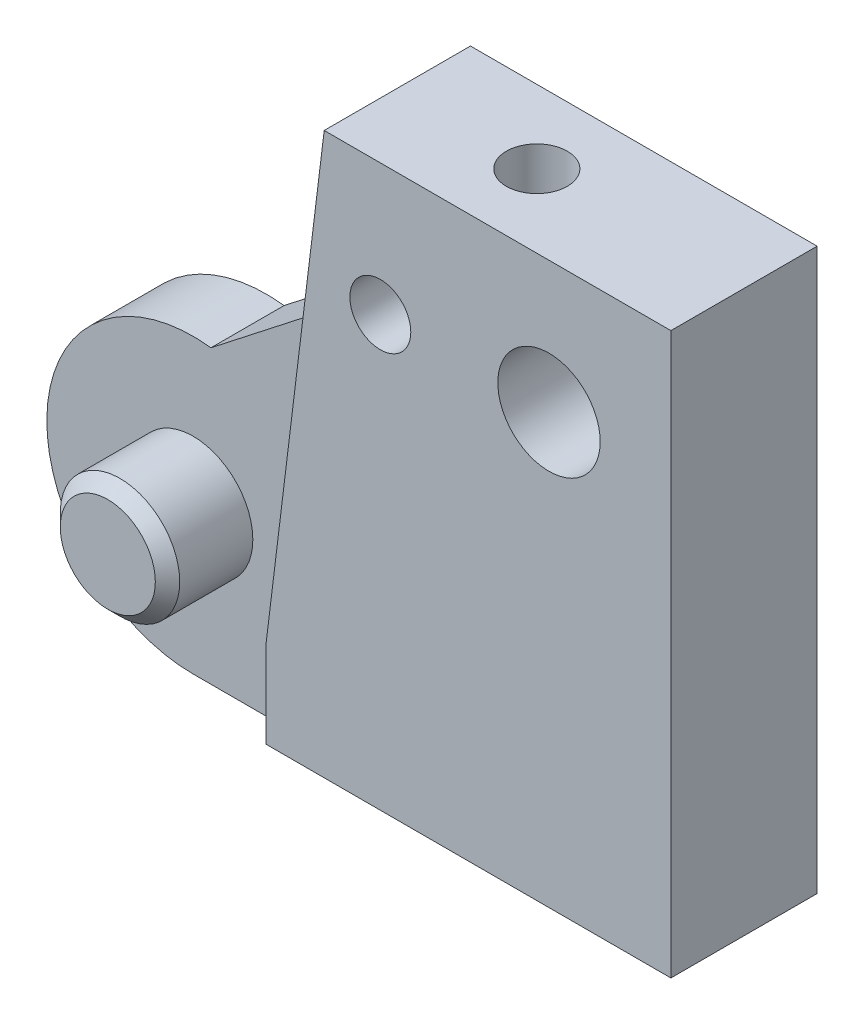
ISO-10303-21;
HEADER;
FILE_DESCRIPTION(('STEP AP214'),'2;1');
FILE_NAME('part.step','',(''),(''),'','','');
FILE_SCHEMA(('AUTOMOTIVE_DESIGN { 1 0 10303 214 1 1 1 1 }'));
ENDSEC;
DATA;
#1=APPLICATION_CONTEXT('core data for automotive mechanical design processes');
#2=APPLICATION_PROTOCOL_DEFINITION('international standard','automotive_design',2000,#1);
#3=PRODUCT_CONTEXT('',#1,'mechanical');
#4=PRODUCT('Part','Part','',(#3));
#5=PRODUCT_RELATED_PRODUCT_CATEGORY('part','',(#4));
#6=PRODUCT_DEFINITION_FORMATION('','',#4);
#7=PRODUCT_DEFINITION_CONTEXT('part definition',#1,'design');
#8=PRODUCT_DEFINITION('design','',#6,#7);
#9=PRODUCT_DEFINITION_SHAPE('','',#8);
#10=(LENGTH_UNIT() NAMED_UNIT(*) SI_UNIT(.MILLI.,.METRE.));
#11=(NAMED_UNIT(*) PLANE_ANGLE_UNIT() SI_UNIT($,.RADIAN.));
#12=(NAMED_UNIT(*) SI_UNIT($,.STERADIAN.) SOLID_ANGLE_UNIT());
#13=UNCERTAINTY_MEASURE_WITH_UNIT(LENGTH_MEASURE(1.E-05),#10,'distance_accuracy_value','');
#14=(GEOMETRIC_REPRESENTATION_CONTEXT(3) GLOBAL_UNCERTAINTY_ASSIGNED_CONTEXT((#13)) GLOBAL_UNIT_ASSIGNED_CONTEXT((#10,
#11,#12)) REPRESENTATION_CONTEXT('',''));
#15=CARTESIAN_POINT('',(0.,0.,0.));
#16=DIRECTION('',(0.,0.,1.));
#17=DIRECTION('',(1.,0.,0.));
#18=AXIS2_PLACEMENT_3D('',#15,#16,#17);
#19=CARTESIAN_POINT('',(0.,0.,3.));
#20=DIRECTION('',(0.,0.,1.));
#21=DIRECTION('',(1.,0.,0.));
#22=AXIS2_PLACEMENT_3D('',#19,#20,#21);
#23=PLANE('',#22);
#24=DIRECTION('',(0.121869343405148,0.992546151641322,0.));
#25=VECTOR('',#24,1.);
#26=CARTESIAN_POINT('',(0.,3.6330242790971,3.));
#27=LINE('',#26,#25);
#28=CARTESIAN_POINT('',(0.,3.6330242790971,3.));
#29=VERTEX_POINT('',#28);
#30=CARTESIAN_POINT('',(1.41770903070971,15.179337759265,3.));
#31=VERTEX_POINT('',#30);
#32=EDGE_CURVE('E52',#29,#31,#27,.T.);
#33=ORIENTED_EDGE('',*,*,#32,.T.);
#34=DIRECTION('',(0.788010753606719,0.615661475325662,0.));
#35=VECTOR('',#34,1.);
#36=CARTESIAN_POINT('',(1.41770903070971,15.179337759265,3.));
#37=LINE('',#36,#35);
#38=CARTESIAN_POINT('',(-5.26878393956911,9.95527690984793,3.));
#39=VERTEX_POINT('',#38);
#40=EDGE_CURVE('E219',#31,#39,#37,.F.);
#41=ORIENTED_EDGE('',*,*,#40,.T.);
#42=CARTESIAN_POINT('',(-6.,4.,3.));
#43=DIRECTION('',(0.,0.,1.));
#44=DIRECTION('',(1.,0.,0.));
#45=AXIS2_PLACEMENT_3D('',#42,#43,#44);
#46=CIRCLE('',#45,6.);
#47=CARTESIAN_POINT('',(-6.,-2.,3.));
#48=VERTEX_POINT('',#47);
#49=EDGE_CURVE('E196',#48,#39,#46,.F.);
#50=ORIENTED_EDGE('',*,*,#49,.F.);
#51=DIRECTION('',(-1.,0.,0.));
#52=VECTOR('',#51,1.);
#53=CARTESIAN_POINT('',(0.,-2.,3.));
#54=LINE('',#53,#52);
#55=CARTESIAN_POINT('',(0.,-2.,3.));
#56=VERTEX_POINT('',#55);
#57=EDGE_CURVE('E199',#56,#48,#54,.T.);
#58=ORIENTED_EDGE('',*,*,#57,.F.);
#59=DIRECTION('',(0.,-1.,0.));
#60=VECTOR('',#59,1.);
#61=CARTESIAN_POINT('',(0.,0.,3.));
#62=LINE('',#61,#60);
#63=CARTESIAN_POINT('',(0.,0.,3.));
#64=VERTEX_POINT('',#63);
#65=EDGE_CURVE('E203',#64,#56,#62,.T.);
#66=ORIENTED_EDGE('',*,*,#65,.F.);
#67=EDGE_CURVE('E204',#29,#64,#62,.T.);
#68=ORIENTED_EDGE('',*,*,#67,.F.);
#69=EDGE_LOOP('',(#33,#41,#50,#58,#66,#68));
#70=FACE_BOUND('',#69,.T.);
#71=CARTESIAN_POINT('',(-6.,4.,3.));
#72=DIRECTION('',(0.,0.,1.));
#73=DIRECTION('',(1.,0.,0.));
#74=AXIS2_PLACEMENT_3D('',#71,#72,#73);
#75=CIRCLE('',#74,2.45);
#76=CARTESIAN_POINT('',(-3.55,4.,3.));
#77=VERTEX_POINT('',#76);
#78=EDGE_CURVE('E135',#77,#77,#75,.T.);
#79=ORIENTED_EDGE('',*,*,#78,.F.);
#80=EDGE_LOOP('',(#79));
#81=FACE_BOUND('',#80,.T.);
#82=ADVANCED_FACE('F37',(#70,#81),#23,.T.);
#83=CARTESIAN_POINT('',(0.,0.,0.));
#84=DIRECTION('',(0.,0.,1.));
#85=DIRECTION('',(1.,0.,0.));
#86=AXIS2_PLACEMENT_3D('',#83,#84,#85);
#87=PLANE('',#86);
#88=CARTESIAN_POINT('',(11.6,17.6,0.));
#89=DIRECTION('',(0.,0.,1.));
#90=DIRECTION('',(1.,0.,0.));
#91=AXIS2_PLACEMENT_3D('',#88,#89,#90);
#92=CIRCLE('',#91,2.09999999999999);
#93=CARTESIAN_POINT('',(13.7,17.6,0.));
#94=VERTEX_POINT('',#93);
#95=EDGE_CURVE('E355',#94,#94,#92,.T.);
#96=ORIENTED_EDGE('',*,*,#95,.T.);
#97=EDGE_LOOP('',(#96));
#98=FACE_BOUND('',#97,.T.);
#99=CARTESIAN_POINT('',(4.68,17.61,0.));
#100=DIRECTION('',(0.,0.,1.));
#101=DIRECTION('',(1.,0.,0.));
#102=AXIS2_PLACEMENT_3D('',#99,#100,#101);
#103=CIRCLE('',#102,1.24999999999999);
#104=CARTESIAN_POINT('',(5.92999999999999,17.61,0.));
#105=VERTEX_POINT('',#104);
#106=EDGE_CURVE('E132',#105,#105,#103,.F.);
#107=ORIENTED_EDGE('',*,*,#106,.F.);
#108=EDGE_LOOP('',(#107));
#109=FACE_BOUND('',#108,.T.);
#110=CARTESIAN_POINT('',(-6.,4.,0.));
#111=DIRECTION('',(0.,0.,1.));
#112=DIRECTION('',(1.,0.,0.));
#113=AXIS2_PLACEMENT_3D('',#110,#111,#112);
#114=CIRCLE('',#113,6.);
#115=CARTESIAN_POINT('',(-6.,-2.,0.));
#116=VERTEX_POINT('',#115);
#117=CARTESIAN_POINT('',(-5.26878393956911,9.95527690984793,0.));
#118=VERTEX_POINT('',#117);
#119=EDGE_CURVE('E195',#116,#118,#114,.F.);
#120=ORIENTED_EDGE('',*,*,#119,.T.);
#121=DIRECTION('',(-0.788010753606719,-0.615661475325662,0.));
#122=VECTOR('',#121,1.);
#123=CARTESIAN_POINT('',(-6.82685619046154,8.73797745516669,0.));
#124=LINE('',#123,#122);
#125=CARTESIAN_POINT('',(1.41770903070971,15.179337759265,0.));
#126=VERTEX_POINT('',#125);
#127=EDGE_CURVE('E60',#118,#126,#124,.F.);
#128=ORIENTED_EDGE('',*,*,#127,.T.);
#129=DIRECTION('',(0.121869343405148,0.992546151641322,0.));
#130=VECTOR('',#129,1.);
#131=CARTESIAN_POINT('',(-0.439454060179394,0.0539581738161256,0.));
#132=LINE('',#131,#130);
#133=CARTESIAN_POINT('',(2.37796560990828,23.,0.));
#134=VERTEX_POINT('',#133);
#135=EDGE_CURVE('E153',#126,#134,#132,.T.);
#136=ORIENTED_EDGE('',*,*,#135,.T.);
#137=DIRECTION('',(1.,0.,0.));
#138=VECTOR('',#137,1.);
#139=CARTESIAN_POINT('',(0.,23.,0.));
#140=LINE('',#139,#138);
#141=CARTESIAN_POINT('',(16.6,23.,0.));
#142=VERTEX_POINT('',#141);
#143=EDGE_CURVE('E171',#134,#142,#140,.T.);
#144=ORIENTED_EDGE('',*,*,#143,.T.);
#145=DIRECTION('',(0.,1.,0.));
#146=VECTOR('',#145,1.);
#147=CARTESIAN_POINT('',(16.6,0.,0.));
#148=LINE('',#147,#146);
#149=CARTESIAN_POINT('',(16.6,0.,0.));
#150=VERTEX_POINT('',#149);
#151=EDGE_CURVE('E182',#150,#142,#148,.T.);
#152=ORIENTED_EDGE('',*,*,#151,.F.);
#153=DIRECTION('',(1.,0.,0.));
#154=VECTOR('',#153,1.);
#155=CARTESIAN_POINT('',(0.,0.,0.));
#156=LINE('',#155,#154);
#157=CARTESIAN_POINT('',(0.,0.,0.));
#158=VERTEX_POINT('',#157);
#159=EDGE_CURVE('E165',#158,#150,#156,.T.);
#160=ORIENTED_EDGE('',*,*,#159,.F.);
#161=DIRECTION('',(0.,-1.,0.));
#162=VECTOR('',#161,1.);
#163=CARTESIAN_POINT('',(0.,0.,0.));
#164=LINE('',#163,#162);
#165=CARTESIAN_POINT('',(0.,-2.,0.));
#166=VERTEX_POINT('',#165);
#167=EDGE_CURVE('E200',#158,#166,#164,.T.);
#168=ORIENTED_EDGE('',*,*,#167,.T.);
#169=DIRECTION('',(-1.,0.,0.));
#170=VECTOR('',#169,1.);
#171=CARTESIAN_POINT('',(0.,-2.,0.));
#172=LINE('',#171,#170);
#173=EDGE_CURVE('E208',#166,#116,#172,.T.);
#174=ORIENTED_EDGE('',*,*,#173,.T.);
#175=EDGE_LOOP('',(#120,#128,#136,#144,#152,#160,#168,#174));
#176=FACE_BOUND('',#175,.T.);
#177=ADVANCED_FACE('F239',(#98,#109,#176),#87,.F.);
#178=CARTESIAN_POINT('',(0.,0.,6.));
#179=DIRECTION('',(-1.,0.,0.));
#180=DIRECTION('',(0.,0.,1.));
#181=AXIS2_PLACEMENT_3D('',#178,#179,#180);
#182=PLANE('',#181);
#183=DIRECTION('',(0.,0.,1.));
#184=VECTOR('',#183,1.);
#185=CARTESIAN_POINT('',(0.,3.6330242790971,3.));
#186=LINE('',#185,#184);
#187=CARTESIAN_POINT('',(0.,3.6330242790971,6.));
#188=VERTEX_POINT('',#187);
#189=EDGE_CURVE('E160',#29,#188,#186,.T.);
#190=ORIENTED_EDGE('',*,*,#189,.F.);
#191=ORIENTED_EDGE('',*,*,#67,.T.);
#192=DIRECTION('',(0.,0.,-1.));
#193=VECTOR('',#192,1.);
#194=CARTESIAN_POINT('',(0.,0.,6.));
#195=LINE('',#194,#193);
#196=CARTESIAN_POINT('',(0.,0.,6.));
#197=VERTEX_POINT('',#196);
#198=EDGE_CURVE('E186',#197,#64,#195,.T.);
#199=ORIENTED_EDGE('',*,*,#198,.F.);
#200=DIRECTION('',(0.,1.,0.));
#201=VECTOR('',#200,1.);
#202=CARTESIAN_POINT('',(0.,0.,6.));
#203=LINE('',#202,#201);
#204=EDGE_CURVE('E176',#197,#188,#203,.T.);
#205=ORIENTED_EDGE('',*,*,#204,.T.);
#206=EDGE_LOOP('',(#190,#191,#199,#205));
#207=FACE_BOUND('',#206,.T.);
#208=ADVANCED_FACE('F244',(#207),#182,.T.);
#209=CARTESIAN_POINT('',(0.,0.,3.));
#210=DIRECTION('',(1.,0.,0.));
#211=DIRECTION('',(0.,1.,0.));
#212=AXIS2_PLACEMENT_3D('',#209,#210,#211);
#213=PLANE('',#212);
#214=ORIENTED_EDGE('',*,*,#167,.F.);
#215=EDGE_CURVE('E179',#64,#158,#195,.T.);
#216=ORIENTED_EDGE('',*,*,#215,.F.);
#217=ORIENTED_EDGE('',*,*,#65,.T.);
#218=DIRECTION('',(0.,0.,-1.));
#219=VECTOR('',#218,1.);
#220=CARTESIAN_POINT('',(0.,-2.,3.));
#221=LINE('',#220,#219);
#222=EDGE_CURVE('E206',#56,#166,#221,.T.);
#223=ORIENTED_EDGE('',*,*,#222,.T.);
#224=EDGE_LOOP('',(#214,#216,#217,#223));
#225=FACE_BOUND('',#224,.T.);
#226=ADVANCED_FACE('F252',(#225),#213,.T.);
#227=CARTESIAN_POINT('',(-6.,4.,3.));
#228=DIRECTION('',(0.,0.,-1.));
#229=DIRECTION('',(-1.,0.,0.));
#230=AXIS2_PLACEMENT_3D('',#227,#228,#229);
#231=CYLINDRICAL_SURFACE('',#230,6.);
#232=ORIENTED_EDGE('',*,*,#119,.F.);
#233=DIRECTION('',(0.,0.,-1.));
#234=VECTOR('',#233,1.);
#235=CARTESIAN_POINT('',(-6.,-2.,3.));
#236=LINE('',#235,#234);
#237=EDGE_CURVE('E214',#48,#116,#236,.T.);
#238=ORIENTED_EDGE('',*,*,#237,.F.);
#239=ORIENTED_EDGE('',*,*,#49,.T.);
#240=DIRECTION('',(0.,0.,1.));
#241=VECTOR('',#240,1.);
#242=CARTESIAN_POINT('',(-5.26878393956911,9.95527690984793,0.));
#243=LINE('',#242,#241);
#244=EDGE_CURVE('E155',#118,#39,#243,.T.);
#245=ORIENTED_EDGE('',*,*,#244,.F.);
#246=EDGE_LOOP('',(#232,#238,#239,#245));
#247=FACE_BOUND('',#246,.T.);
#248=ADVANCED_FACE('F255',(#247),#231,.T.);
#249=CARTESIAN_POINT('',(0.,-2.,3.));
#250=DIRECTION('',(0.,-1.,0.));
#251=DIRECTION('',(1.,0.,0.));
#252=AXIS2_PLACEMENT_3D('',#249,#250,#251);
#253=PLANE('',#252);
#254=ORIENTED_EDGE('',*,*,#173,.F.);
#255=ORIENTED_EDGE('',*,*,#222,.F.);
#256=ORIENTED_EDGE('',*,*,#57,.T.);
#257=ORIENTED_EDGE('',*,*,#237,.T.);
#258=EDGE_LOOP('',(#254,#255,#256,#257));
#259=FACE_BOUND('',#258,.T.);
#260=ADVANCED_FACE('F257',(#259),#253,.T.);
#261=CARTESIAN_POINT('',(0.,0.,6.));
#262=DIRECTION('',(0.,1.,0.));
#263=DIRECTION('',(0.,0.,1.));
#264=AXIS2_PLACEMENT_3D('',#261,#262,#263);
#265=PLANE('',#264);
#266=CARTESIAN_POINT('',(4.,0.,3.));
#267=DIRECTION('',(0.,-1.,0.));
#268=DIRECTION('',(0.,0.,-1.));
#269=AXIS2_PLACEMENT_3D('',#266,#267,#268);
#270=CIRCLE('',#269,1.24999999999999);
#271=CARTESIAN_POINT('',(4.,0.,1.75000000000001));
#272=VERTEX_POINT('',#271);
#273=EDGE_CURVE('E140',#272,#272,#270,.T.);
#274=ORIENTED_EDGE('',*,*,#273,.F.);
#275=EDGE_LOOP('',(#274));
#276=FACE_BOUND('',#275,.T.);
#277=CARTESIAN_POINT('',(12.6,0.,3.));
#278=DIRECTION('',(0.,-1.,0.));
#279=DIRECTION('',(0.,0.,-1.));
#280=AXIS2_PLACEMENT_3D('',#277,#278,#279);
#281=CIRCLE('',#280,1.24999999999999);
#282=CARTESIAN_POINT('',(12.6,0.,1.75000000000001));
#283=VERTEX_POINT('',#282);
#284=EDGE_CURVE('E147',#283,#283,#281,.T.);
#285=ORIENTED_EDGE('',*,*,#284,.F.);
#286=EDGE_LOOP('',(#285));
#287=FACE_BOUND('',#286,.T.);
#288=ORIENTED_EDGE('',*,*,#159,.T.);
#289=DIRECTION('',(0.,0.,-1.));
#290=VECTOR('',#289,1.);
#291=CARTESIAN_POINT('',(16.6,0.,6.));
#292=LINE('',#291,#290);
#293=CARTESIAN_POINT('',(16.6,0.,6.));
#294=VERTEX_POINT('',#293);
#295=EDGE_CURVE('E192',#294,#150,#292,.T.);
#296=ORIENTED_EDGE('',*,*,#295,.F.);
#297=DIRECTION('',(1.,0.,0.));
#298=VECTOR('',#297,1.);
#299=CARTESIAN_POINT('',(0.,0.,6.));
#300=LINE('',#299,#298);
#301=EDGE_CURVE('E167',#197,#294,#300,.T.);
#302=ORIENTED_EDGE('',*,*,#301,.F.);
#303=ORIENTED_EDGE('',*,*,#198,.T.);
#304=ORIENTED_EDGE('',*,*,#215,.T.);
#305=EDGE_LOOP('',(#288,#296,#302,#303,#304));
#306=FACE_BOUND('',#305,.T.);
#307=ADVANCED_FACE('F249',(#276,#287,#306),#265,.F.);
#308=CARTESIAN_POINT('',(16.6,0.,6.));
#309=DIRECTION('',(-1.,0.,0.));
#310=DIRECTION('',(0.,-1.,0.));
#311=AXIS2_PLACEMENT_3D('',#308,#309,#310);
#312=PLANE('',#311);
#313=ORIENTED_EDGE('',*,*,#151,.T.);
#314=DIRECTION('',(0.,0.,-1.));
#315=VECTOR('',#314,1.);
#316=CARTESIAN_POINT('',(16.6,23.,6.));
#317=LINE('',#316,#315);
#318=CARTESIAN_POINT('',(16.6,23.,6.));
#319=VERTEX_POINT('',#318);
#320=EDGE_CURVE('E189',#319,#142,#317,.T.);
#321=ORIENTED_EDGE('',*,*,#320,.F.);
#322=DIRECTION('',(0.,1.,0.));
#323=VECTOR('',#322,1.);
#324=CARTESIAN_POINT('',(16.6,0.,6.));
#325=LINE('',#324,#323);
#326=EDGE_CURVE('E170',#294,#319,#325,.T.);
#327=ORIENTED_EDGE('',*,*,#326,.F.);
#328=ORIENTED_EDGE('',*,*,#295,.T.);
#329=EDGE_LOOP('',(#313,#321,#327,#328));
#330=FACE_BOUND('',#329,.T.);
#331=ADVANCED_FACE('F288',(#330),#312,.F.);
#332=CARTESIAN_POINT('',(0.,23.,6.));
#333=DIRECTION('',(0.,1.,0.));
#334=DIRECTION('',(0.,0.,1.));
#335=AXIS2_PLACEMENT_3D('',#332,#333,#334);
#336=PLANE('',#335);
#337=CARTESIAN_POINT('',(8.1,23.,3.));
#338=DIRECTION('',(0.,1.,0.));
#339=DIRECTION('',(0.,0.,1.));
#340=AXIS2_PLACEMENT_3D('',#337,#338,#339);
#341=CIRCLE('',#340,1.24999999999999);
#342=CARTESIAN_POINT('',(8.1,23.,4.24999999999999));
#343=VERTEX_POINT('',#342);
#344=EDGE_CURVE('E129',#343,#343,#341,.T.);
#345=ORIENTED_EDGE('',*,*,#344,.F.);
#346=EDGE_LOOP('',(#345));
#347=FACE_BOUND('',#346,.T.);
#348=ORIENTED_EDGE('',*,*,#143,.F.);
#349=DIRECTION('',(0.,0.,1.));
#350=VECTOR('',#349,1.);
#351=CARTESIAN_POINT('',(2.37796560990828,23.,3.));
#352=LINE('',#351,#350);
#353=CARTESIAN_POINT('',(2.37796560990828,23.,6.));
#354=VERTEX_POINT('',#353);
#355=EDGE_CURVE('E162',#134,#354,#352,.T.);
#356=ORIENTED_EDGE('',*,*,#355,.T.);
#357=DIRECTION('',(1.,0.,0.));
#358=VECTOR('',#357,1.);
#359=CARTESIAN_POINT('',(0.,23.,6.));
#360=LINE('',#359,#358);
#361=EDGE_CURVE('E174',#354,#319,#360,.T.);
#362=ORIENTED_EDGE('',*,*,#361,.T.);
#363=ORIENTED_EDGE('',*,*,#320,.T.);
#364=EDGE_LOOP('',(#348,#356,#362,#363));
#365=FACE_BOUND('',#364,.T.);
#366=ADVANCED_FACE('F285',(#347,#365),#336,.T.);
#367=CARTESIAN_POINT('',(0.,0.,6.));
#368=DIRECTION('',(0.,0.,1.));
#369=DIRECTION('',(1.,0.,0.));
#370=AXIS2_PLACEMENT_3D('',#367,#368,#369);
#371=PLANE('',#370);
#372=CARTESIAN_POINT('',(11.6,17.6,6.));
#373=DIRECTION('',(0.,0.,1.));
#374=DIRECTION('',(1.,0.,0.));
#375=AXIS2_PLACEMENT_3D('',#372,#373,#374);
#376=CIRCLE('',#375,2.09999999999999);
#377=CARTESIAN_POINT('',(13.7,17.6,6.));
#378=VERTEX_POINT('',#377);
#379=EDGE_CURVE('E357',#378,#378,#376,.T.);
#380=ORIENTED_EDGE('',*,*,#379,.F.);
#381=EDGE_LOOP('',(#380));
#382=FACE_BOUND('',#381,.T.);
#383=CARTESIAN_POINT('',(4.68,17.61,6.));
#384=DIRECTION('',(0.,0.,1.));
#385=DIRECTION('',(1.,0.,0.));
#386=AXIS2_PLACEMENT_3D('',#383,#384,#385);
#387=CIRCLE('',#386,1.24999999999999);
#388=CARTESIAN_POINT('',(5.92999999999999,17.61,6.));
#389=VERTEX_POINT('',#388);
#390=EDGE_CURVE('E128',#389,#389,#387,.T.);
#391=ORIENTED_EDGE('',*,*,#390,.F.);
#392=EDGE_LOOP('',(#391));
#393=FACE_BOUND('',#392,.T.);
#394=DIRECTION('',(0.121869343405148,0.992546151641322,0.));
#395=VECTOR('',#394,1.);
#396=CARTESIAN_POINT('',(0.,3.6330242790971,6.));
#397=LINE('',#396,#395);
#398=EDGE_CURVE('E158',#188,#354,#397,.T.);
#399=ORIENTED_EDGE('',*,*,#398,.F.);
#400=ORIENTED_EDGE('',*,*,#204,.F.);
#401=ORIENTED_EDGE('',*,*,#301,.T.);
#402=ORIENTED_EDGE('',*,*,#326,.T.);
#403=ORIENTED_EDGE('',*,*,#361,.F.);
#404=EDGE_LOOP('',(#399,#400,#401,#402,#403));
#405=FACE_BOUND('',#404,.T.);
#406=ADVANCED_FACE('F275',(#382,#393,#405),#371,.T.);
#407=CARTESIAN_POINT('',(0.,3.6330242790971,3.));
#408=DIRECTION('',(0.992546151641322,-0.121869343405148,0.));
#409=DIRECTION('',(0.121869343405148,0.992546151641322,0.));
#410=AXIS2_PLACEMENT_3D('',#407,#408,#409);
#411=PLANE('',#410);
#412=ORIENTED_EDGE('',*,*,#135,.F.);
#413=DIRECTION('',(0.,0.,1.));
#414=VECTOR('',#413,1.);
#415=CARTESIAN_POINT('',(1.41770903070971,15.179337759265,3.));
#416=LINE('',#415,#414);
#417=EDGE_CURVE('E216',#126,#31,#416,.T.);
#418=ORIENTED_EDGE('',*,*,#417,.T.);
#419=ORIENTED_EDGE('',*,*,#32,.F.);
#420=ORIENTED_EDGE('',*,*,#189,.T.);
#421=ORIENTED_EDGE('',*,*,#398,.T.);
#422=ORIENTED_EDGE('',*,*,#355,.F.);
#423=EDGE_LOOP('',(#412,#418,#419,#420,#421,#422));
#424=FACE_BOUND('',#423,.T.);
#425=ADVANCED_FACE('F266',(#424),#411,.F.);
#426=CARTESIAN_POINT('',(1.41770903070971,15.179337759265,3.));
#427=DIRECTION('',(-0.615661475325662,0.788010753606719,0.));
#428=DIRECTION('',(0.,0.,-1.));
#429=AXIS2_PLACEMENT_3D('',#426,#427,#428);
#430=PLANE('',#429);
#431=ORIENTED_EDGE('',*,*,#127,.F.);
#432=ORIENTED_EDGE('',*,*,#244,.T.);
#433=ORIENTED_EDGE('',*,*,#40,.F.);
#434=ORIENTED_EDGE('',*,*,#417,.F.);
#435=EDGE_LOOP('',(#431,#432,#433,#434));
#436=FACE_BOUND('',#435,.T.);
#437=ADVANCED_FACE('F263',(#436),#430,.T.);
#438=CARTESIAN_POINT('',(12.6,8.49999999999999,3.));
#439=DIRECTION('',(0.,-1.,0.));
#440=DIRECTION('',(0.,0.,-1.));
#441=AXIS2_PLACEMENT_3D('',#438,#439,#440);
#442=CONICAL_SURFACE('',#441,1.24999999999999,1.02974425867665);
#443=CARTESIAN_POINT('',(12.6,9.25107577378444,3.));
#444=VERTEX_POINT('',#443);
#445=VERTEX_LOOP('',#444);
#446=FACE_BOUND('',#445,.T.);
#447=CARTESIAN_POINT('',(12.6,8.49999999999999,3.));
#448=DIRECTION('',(0.,-1.,0.));
#449=DIRECTION('',(0.,0.,-1.));
#450=AXIS2_PLACEMENT_3D('',#447,#448,#449);
#451=CIRCLE('',#450,1.24999999999999);
#452=CARTESIAN_POINT('',(12.6,8.49999999999999,1.75000000000001));
#453=VERTEX_POINT('',#452);
#454=EDGE_CURVE('E150',#453,#453,#451,.T.);
#455=ORIENTED_EDGE('',*,*,#454,.T.);
#456=EDGE_LOOP('',(#455));
#457=FACE_BOUND('',#456,.T.);
#458=ADVANCED_FACE('F265',(#446,#457),#442,.F.);
#459=CARTESIAN_POINT('',(12.6,0.,3.));
#460=DIRECTION('',(0.,-1.,0.));
#461=DIRECTION('',(0.,0.,-1.));
#462=AXIS2_PLACEMENT_3D('',#459,#460,#461);
#463=CYLINDRICAL_SURFACE('',#462,1.24999999999999);
#464=ORIENTED_EDGE('',*,*,#454,.F.);
#465=EDGE_LOOP('',(#464));
#466=FACE_BOUND('',#465,.T.);
#467=ORIENTED_EDGE('',*,*,#284,.T.);
#468=EDGE_LOOP('',(#467));
#469=FACE_BOUND('',#468,.T.);
#470=ADVANCED_FACE('F272',(#466,#469),#463,.F.);
#471=CARTESIAN_POINT('',(4.,8.49999999999999,3.));
#472=DIRECTION('',(0.,-1.,0.));
#473=DIRECTION('',(0.,0.,-1.));
#474=AXIS2_PLACEMENT_3D('',#471,#472,#473);
#475=CONICAL_SURFACE('',#474,1.24999999999999,1.02974425867665);
#476=CARTESIAN_POINT('',(4.,9.25107577378444,3.));
#477=VERTEX_POINT('',#476);
#478=VERTEX_LOOP('',#477);
#479=FACE_BOUND('',#478,.T.);
#480=CARTESIAN_POINT('',(4.,8.49999999999999,3.));
#481=DIRECTION('',(0.,-1.,0.));
#482=DIRECTION('',(0.,0.,-1.));
#483=AXIS2_PLACEMENT_3D('',#480,#481,#482);
#484=CIRCLE('',#483,1.24999999999999);
#485=CARTESIAN_POINT('',(4.,8.49999999999999,1.75000000000001));
#486=VERTEX_POINT('',#485);
#487=EDGE_CURVE('E144',#486,#486,#484,.T.);
#488=ORIENTED_EDGE('',*,*,#487,.T.);
#489=EDGE_LOOP('',(#488));
#490=FACE_BOUND('',#489,.T.);
#491=ADVANCED_FACE('F329',(#479,#490),#475,.F.);
#492=CARTESIAN_POINT('',(4.,0.,3.));
#493=DIRECTION('',(0.,-1.,0.));
#494=DIRECTION('',(0.,0.,-1.));
#495=AXIS2_PLACEMENT_3D('',#492,#493,#494);
#496=CYLINDRICAL_SURFACE('',#495,1.24999999999999);
#497=ORIENTED_EDGE('',*,*,#487,.F.);
#498=EDGE_LOOP('',(#497));
#499=FACE_BOUND('',#498,.T.);
#500=ORIENTED_EDGE('',*,*,#273,.T.);
#501=EDGE_LOOP('',(#500));
#502=FACE_BOUND('',#501,.T.);
#503=ADVANCED_FACE('F335',(#499,#502),#496,.F.);
#504=CARTESIAN_POINT('',(4.68,17.61,6.));
#505=DIRECTION('',(0.,0.,1.));
#506=DIRECTION('',(1.,0.,0.));
#507=AXIS2_PLACEMENT_3D('',#504,#505,#506);
#508=CYLINDRICAL_SURFACE('',#507,1.24999999999999);
#509=ORIENTED_EDGE('',*,*,#106,.T.);
#510=EDGE_LOOP('',(#509));
#511=FACE_BOUND('',#510,.T.);
#512=ORIENTED_EDGE('',*,*,#390,.T.);
#513=EDGE_LOOP('',(#512));
#514=FACE_BOUND('',#513,.T.);
#515=ADVANCED_FACE('F122',(#511,#514),#508,.F.);
#516=CARTESIAN_POINT('',(8.1,20.,3.));
#517=DIRECTION('',(0.,1.,0.));
#518=DIRECTION('',(0.,0.,1.));
#519=AXIS2_PLACEMENT_3D('',#516,#517,#518);
#520=CONICAL_SURFACE('',#519,1.25,1.02974425867665);
#521=CARTESIAN_POINT('',(8.09999999999999,19.2489242262155,3.));
#522=VERTEX_POINT('',#521);
#523=VERTEX_LOOP('',#522);
#524=FACE_BOUND('',#523,.T.);
#525=CARTESIAN_POINT('',(8.1,20.,3.));
#526=DIRECTION('',(0.,1.,0.));
#527=DIRECTION('',(0.,0.,1.));
#528=AXIS2_PLACEMENT_3D('',#525,#526,#527);
#529=CIRCLE('',#528,1.25);
#530=CARTESIAN_POINT('',(8.1,20.,4.25));
#531=VERTEX_POINT('',#530);
#532=EDGE_CURVE('E126',#531,#531,#529,.T.);
#533=ORIENTED_EDGE('',*,*,#532,.T.);
#534=EDGE_LOOP('',(#533));
#535=FACE_BOUND('',#534,.T.);
#536=ADVANCED_FACE('F118',(#524,#535),#520,.F.);
#537=CARTESIAN_POINT('',(8.1,23.,3.));
#538=DIRECTION('',(0.,1.,0.));
#539=DIRECTION('',(0.,0.,1.));
#540=AXIS2_PLACEMENT_3D('',#537,#538,#539);
#541=CYLINDRICAL_SURFACE('',#540,1.24999999999999);
#542=ORIENTED_EDGE('',*,*,#532,.F.);
#543=EDGE_LOOP('',(#542));
#544=FACE_BOUND('',#543,.T.);
#545=ORIENTED_EDGE('',*,*,#344,.T.);
#546=EDGE_LOOP('',(#545));
#547=FACE_BOUND('',#546,.T.);
#548=ADVANCED_FACE('F121',(#544,#547),#541,.F.);
#549=CARTESIAN_POINT('',(-6.,4.,6.5));
#550=DIRECTION('',(0.,0.,-1.));
#551=DIRECTION('',(-1.,0.,0.));
#552=AXIS2_PLACEMENT_3D('',#549,#550,#551);
#553=CYLINDRICAL_SURFACE('',#552,2.45);
#554=CARTESIAN_POINT('',(-6.,4.,5.99999999999999));
#555=DIRECTION('',(0.,0.,1.));
#556=DIRECTION('',(1.,0.,0.));
#557=AXIS2_PLACEMENT_3D('',#554,#555,#556);
#558=CIRCLE('',#557,2.45);
#559=CARTESIAN_POINT('',(-3.55,4.,5.99999999999999));
#560=VERTEX_POINT('',#559);
#561=EDGE_CURVE('E11',#560,#560,#558,.F.);
#562=ORIENTED_EDGE('',*,*,#561,.T.);
#563=EDGE_LOOP('',(#562));
#564=FACE_BOUND('',#563,.T.);
#565=ORIENTED_EDGE('',*,*,#78,.T.);
#566=EDGE_LOOP('',(#565));
#567=FACE_BOUND('',#566,.T.);
#568=ADVANCED_FACE('F235',(#564,#567),#553,.T.);
#569=CARTESIAN_POINT('',(-6.,4.,6.5));
#570=DIRECTION('',(0.,0.,1.));
#571=DIRECTION('',(1.,0.,0.));
#572=AXIS2_PLACEMENT_3D('',#569,#570,#571);
#573=PLANE('',#572);
#574=CARTESIAN_POINT('',(-6.,4.,6.5));
#575=DIRECTION('',(0.,0.,1.));
#576=DIRECTION('',(1.,0.,0.));
#577=AXIS2_PLACEMENT_3D('',#574,#575,#576);
#578=CIRCLE('',#577,1.95);
#579=CARTESIAN_POINT('',(-4.05000000000001,4.,6.5));
#580=VERTEX_POINT('',#579);
#581=EDGE_CURVE('E45',#580,#580,#578,.T.);
#582=ORIENTED_EDGE('',*,*,#581,.T.);
#583=EDGE_LOOP('',(#582));
#584=FACE_BOUND('',#583,.T.);
#585=ADVANCED_FACE('F224',(#584),#573,.T.);
#586=CARTESIAN_POINT('',(-6.,4.,6.5));
#587=DIRECTION('',(0.,0.,-1.));
#588=DIRECTION('',(-1.,0.,0.));
#589=AXIS2_PLACEMENT_3D('',#586,#587,#588);
#590=CONICAL_SURFACE('',#589,1.95,0.785398163397444);
#591=ORIENTED_EDGE('',*,*,#561,.F.);
#592=EDGE_LOOP('',(#591));
#593=FACE_BOUND('',#592,.T.);
#594=ORIENTED_EDGE('',*,*,#581,.F.);
#595=EDGE_LOOP('',(#594));
#596=FACE_BOUND('',#595,.T.);
#597=ADVANCED_FACE('F39',(#593,#596),#590,.T.);
#598=CARTESIAN_POINT('',(11.6,17.6,6.));
#599=DIRECTION('',(0.,0.,1.));
#600=DIRECTION('',(1.,0.,0.));
#601=AXIS2_PLACEMENT_3D('',#598,#599,#600);
#602=CYLINDRICAL_SURFACE('',#601,2.09999999999999);
#603=ORIENTED_EDGE('',*,*,#379,.T.);
#604=EDGE_LOOP('',(#603));
#605=FACE_BOUND('',#604,.T.);
#606=ORIENTED_EDGE('',*,*,#95,.F.);
#607=EDGE_LOOP('',(#606));
#608=FACE_BOUND('',#607,.T.);
#609=ADVANCED_FACE('F227',(#605,#608),#602,.F.);
#610=CLOSED_SHELL('',(#82,#177,#208,#226,#248,#260,#307,#331,#366,#406,#425,#437,#458,#470,#491,
#503,#515,#536,#548,#568,#585,#597,#609));
#611=MANIFOLD_SOLID_BREP('B2',#610);
#612=ADVANCED_BREP_SHAPE_REPRESENTATION('',(#18,#611),#14);
#613=SHAPE_DEFINITION_REPRESENTATION(#9,#612);
ENDSEC;
END-ISO-10303-21;
